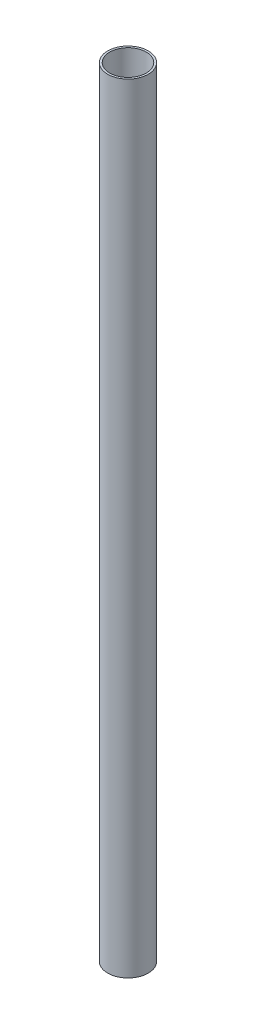
ISO-10303-21;
HEADER;
FILE_DESCRIPTION(('STEP AP214'),'2;1');
FILE_NAME('part.step','',(''),(''),'','','');
FILE_SCHEMA(('AUTOMOTIVE_DESIGN { 1 0 10303 214 1 1 1 1 }'));
ENDSEC;
DATA;
#1=APPLICATION_CONTEXT('core data for automotive mechanical design processes');
#2=APPLICATION_PROTOCOL_DEFINITION('international standard','automotive_design',2000,#1);
#3=PRODUCT_CONTEXT('',#1,'mechanical');
#4=PRODUCT('Part','Part','',(#3));
#5=PRODUCT_RELATED_PRODUCT_CATEGORY('part','',(#4));
#6=PRODUCT_DEFINITION_FORMATION('','',#4);
#7=PRODUCT_DEFINITION_CONTEXT('part definition',#1,'design');
#8=PRODUCT_DEFINITION('design','',#6,#7);
#9=PRODUCT_DEFINITION_SHAPE('','',#8);
#10=(LENGTH_UNIT() NAMED_UNIT(*) SI_UNIT(.MILLI.,.METRE.));
#11=(NAMED_UNIT(*) PLANE_ANGLE_UNIT() SI_UNIT($,.RADIAN.));
#12=(NAMED_UNIT(*) SI_UNIT($,.STERADIAN.) SOLID_ANGLE_UNIT());
#13=UNCERTAINTY_MEASURE_WITH_UNIT(LENGTH_MEASURE(1.E-05),#10,'distance_accuracy_value','');
#14=(GEOMETRIC_REPRESENTATION_CONTEXT(3) GLOBAL_UNCERTAINTY_ASSIGNED_CONTEXT((#13)) GLOBAL_UNIT_ASSIGNED_CONTEXT((#10,
#11,#12)) REPRESENTATION_CONTEXT('',''));
#15=CARTESIAN_POINT('',(0.,0.,0.));
#16=DIRECTION('',(0.,0.,1.));
#17=DIRECTION('',(1.,0.,0.));
#18=AXIS2_PLACEMENT_3D('',#15,#16,#17);
#19=CARTESIAN_POINT('',(0.,304.8,0.));
#20=DIRECTION('',(0.,1.,0.));
#21=DIRECTION('',(0.,0.,1.));
#22=AXIS2_PLACEMENT_3D('',#19,#20,#21);
#23=PLANE('',#22);
#24=CARTESIAN_POINT('',(0.,304.8,0.));
#25=DIRECTION('',(0.,1.,0.));
#26=DIRECTION('',(0.,0.,1.));
#27=AXIS2_PLACEMENT_3D('',#24,#25,#26);
#28=CIRCLE('',#27,15.875);
#29=CARTESIAN_POINT('',(0.,304.8,15.875));
#30=VERTEX_POINT('',#29);
#31=EDGE_CURVE('E10',#30,#30,#28,.T.);
#32=ORIENTED_EDGE('',*,*,#31,.T.);
#33=EDGE_LOOP('',(#32));
#34=FACE_BOUND('',#33,.T.);
#35=CARTESIAN_POINT('',(0.,304.8,0.));
#36=DIRECTION('',(0.,1.,0.));
#37=DIRECTION('',(0.,0.,1.));
#38=AXIS2_PLACEMENT_3D('',#35,#36,#37);
#39=CIRCLE('',#38,14.2875);
#40=CARTESIAN_POINT('',(0.,304.8,14.2875));
#41=VERTEX_POINT('',#40);
#42=EDGE_CURVE('E43',#41,#41,#39,.T.);
#43=ORIENTED_EDGE('',*,*,#42,.F.);
#44=EDGE_LOOP('',(#43));
#45=FACE_BOUND('',#44,.T.);
#46=ADVANCED_FACE('F32',(#34,#45),#23,.T.);
#47=CARTESIAN_POINT('',(0.,-304.8,0.));
#48=DIRECTION('',(0.,1.,0.));
#49=DIRECTION('',(0.,0.,1.));
#50=AXIS2_PLACEMENT_3D('',#47,#48,#49);
#51=PLANE('',#50);
#52=CARTESIAN_POINT('',(0.,-304.8,0.));
#53=DIRECTION('',(0.,1.,0.));
#54=DIRECTION('',(0.,0.,1.));
#55=AXIS2_PLACEMENT_3D('',#52,#53,#54);
#56=CIRCLE('',#55,15.875);
#57=CARTESIAN_POINT('',(0.,-304.8,15.875));
#58=VERTEX_POINT('',#57);
#59=EDGE_CURVE('E36',#58,#58,#56,.T.);
#60=ORIENTED_EDGE('',*,*,#59,.F.);
#61=EDGE_LOOP('',(#60));
#62=FACE_BOUND('',#61,.T.);
#63=CARTESIAN_POINT('',(0.,-304.8,0.));
#64=DIRECTION('',(0.,1.,0.));
#65=DIRECTION('',(0.,0.,1.));
#66=AXIS2_PLACEMENT_3D('',#63,#64,#65);
#67=CIRCLE('',#66,14.2875);
#68=CARTESIAN_POINT('',(0.,-304.8,14.2875));
#69=VERTEX_POINT('',#68);
#70=EDGE_CURVE('E45',#69,#69,#67,.T.);
#71=ORIENTED_EDGE('',*,*,#70,.T.);
#72=EDGE_LOOP('',(#71));
#73=FACE_BOUND('',#72,.T.);
#74=ADVANCED_FACE('F55',(#62,#73),#51,.F.);
#75=CARTESIAN_POINT('',(0.,304.8,0.));
#76=DIRECTION('',(0.,-1.,0.));
#77=DIRECTION('',(0.,0.,-1.));
#78=AXIS2_PLACEMENT_3D('',#75,#76,#77);
#79=CYLINDRICAL_SURFACE('',#78,15.875);
#80=ORIENTED_EDGE('',*,*,#31,.F.);
#81=EDGE_LOOP('',(#80));
#82=FACE_BOUND('',#81,.T.);
#83=ORIENTED_EDGE('',*,*,#59,.T.);
#84=EDGE_LOOP('',(#83));
#85=FACE_BOUND('',#84,.T.);
#86=ADVANCED_FACE('F34',(#82,#85),#79,.T.);
#87=CARTESIAN_POINT('',(0.,304.8,0.));
#88=DIRECTION('',(0.,-1.,0.));
#89=DIRECTION('',(0.,0.,-1.));
#90=AXIS2_PLACEMENT_3D('',#87,#88,#89);
#91=CYLINDRICAL_SURFACE('',#90,14.2875);
#92=ORIENTED_EDGE('',*,*,#42,.T.);
#93=EDGE_LOOP('',(#92));
#94=FACE_BOUND('',#93,.T.);
#95=ORIENTED_EDGE('',*,*,#70,.F.);
#96=EDGE_LOOP('',(#95));
#97=FACE_BOUND('',#96,.T.);
#98=ADVANCED_FACE('F51',(#94,#97),#91,.F.);
#99=CLOSED_SHELL('',(#46,#74,#86,#98));
#100=MANIFOLD_SOLID_BREP('B2',#99);
#101=ADVANCED_BREP_SHAPE_REPRESENTATION('',(#18,#100),#14);
#102=SHAPE_DEFINITION_REPRESENTATION(#9,#101);
ENDSEC;
END-ISO-10303-21;
